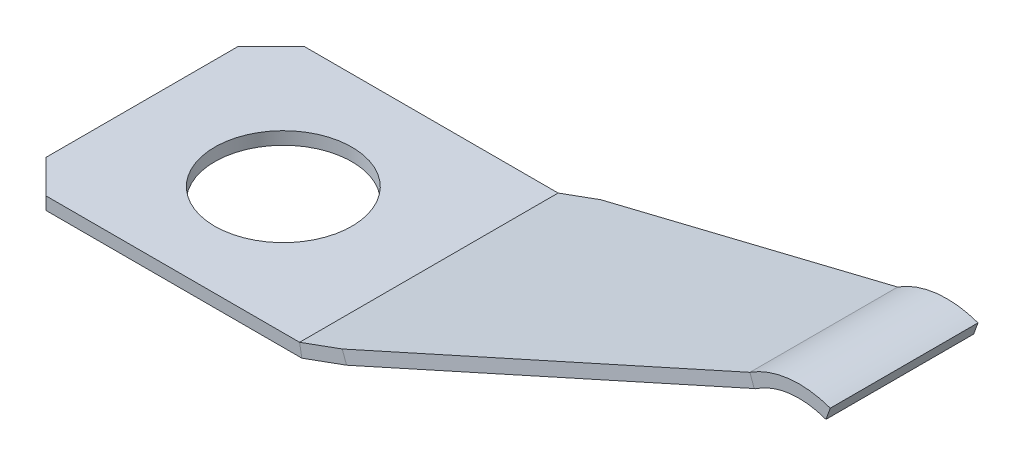
ISO-10303-21;
HEADER;
FILE_DESCRIPTION(('STEP AP214'),'2;1');
FILE_NAME('part.step','',(''),(''),'','','');
FILE_SCHEMA(('AUTOMOTIVE_DESIGN { 1 0 10303 214 1 1 1 1 }'));
ENDSEC;
DATA;
#1=APPLICATION_CONTEXT('core data for automotive mechanical design processes');
#2=APPLICATION_PROTOCOL_DEFINITION('international standard','automotive_design',2000,#1);
#3=PRODUCT_CONTEXT('',#1,'mechanical');
#4=PRODUCT('Part','Part','',(#3));
#5=PRODUCT_RELATED_PRODUCT_CATEGORY('part','',(#4));
#6=PRODUCT_DEFINITION_FORMATION('','',#4);
#7=PRODUCT_DEFINITION_CONTEXT('part definition',#1,'design');
#8=PRODUCT_DEFINITION('design','',#6,#7);
#9=PRODUCT_DEFINITION_SHAPE('','',#8);
#10=(LENGTH_UNIT() NAMED_UNIT(*) SI_UNIT(.MILLI.,.METRE.));
#11=(NAMED_UNIT(*) PLANE_ANGLE_UNIT() SI_UNIT($,.RADIAN.));
#12=(NAMED_UNIT(*) SI_UNIT($,.STERADIAN.) SOLID_ANGLE_UNIT());
#13=UNCERTAINTY_MEASURE_WITH_UNIT(LENGTH_MEASURE(1.E-05),#10,'distance_accuracy_value','');
#14=(GEOMETRIC_REPRESENTATION_CONTEXT(3) GLOBAL_UNCERTAINTY_ASSIGNED_CONTEXT((#13)) GLOBAL_UNIT_ASSIGNED_CONTEXT((#10,
#11,#12)) REPRESENTATION_CONTEXT('',''));
#15=CARTESIAN_POINT('',(0.,0.,0.));
#16=DIRECTION('',(0.,0.,1.));
#17=DIRECTION('',(1.,0.,0.));
#18=AXIS2_PLACEMENT_3D('',#15,#16,#17);
#19=CARTESIAN_POINT('',(14.9758937338187,-5.44411439079338,0.));
#20=DIRECTION('',(0.939826980375197,-0.34165076753732,0.));
#21=DIRECTION('',(0.34165076753732,0.939826980375197,0.));
#22=AXIS2_PLACEMENT_3D('',#19,#20,#21);
#23=PLANE('',#22);
#24=DIRECTION('',(-0.34165076753732,-0.939826980375197,0.));
#25=VECTOR('',#24,1.);
#26=CARTESIAN_POINT('',(14.9758937338187,-5.44411439079338,-1.77799999999999));
#27=LINE('',#26,#25);
#28=CARTESIAN_POINT('',(18.3482597843654,3.83272881623656,-1.77799999999999));
#29=VERTEX_POINT('',#28);
#30=CARTESIAN_POINT('',(18.24412463042,3.54626955261821,-1.77799999999999));
#31=VERTEX_POINT('',#30);
#32=EDGE_CURVE('E144',#29,#31,#27,.T.);
#33=ORIENTED_EDGE('',*,*,#32,.F.);
#34=DIRECTION('',(0.,0.,1.));
#35=VECTOR('',#34,1.);
#36=CARTESIAN_POINT('',(18.3482597843654,3.83272881623656,3.1115));
#37=LINE('',#36,#35);
#38=CARTESIAN_POINT('',(18.3482597843654,3.83272881623657,1.77800000000001));
#39=VERTEX_POINT('',#38);
#40=EDGE_CURVE('E39',#29,#39,#37,.T.);
#41=ORIENTED_EDGE('',*,*,#40,.T.);
#42=DIRECTION('',(-0.34165076753732,-0.939826980375197,0.));
#43=VECTOR('',#42,1.);
#44=CARTESIAN_POINT('',(14.9758937338187,-5.44411439079338,1.778));
#45=LINE('',#44,#43);
#46=CARTESIAN_POINT('',(18.24412463042,3.54626955261821,1.77800000000001));
#47=VERTEX_POINT('',#46);
#48=EDGE_CURVE('E250',#39,#47,#45,.T.);
#49=ORIENTED_EDGE('',*,*,#48,.T.);
#50=DIRECTION('',(0.,0.,-1.));
#51=VECTOR('',#50,1.);
#52=CARTESIAN_POINT('',(18.24412463042,3.54626955261821,3.1115));
#53=LINE('',#52,#51);
#54=EDGE_CURVE('E176',#47,#31,#53,.T.);
#55=ORIENTED_EDGE('',*,*,#54,.T.);
#56=EDGE_LOOP('',(#33,#41,#49,#55));
#57=FACE_BOUND('',#56,.T.);
#58=ADVANCED_FACE('F36',(#57),#23,.T.);
#59=CARTESIAN_POINT('',(17.6019578477569,1.77977076030499,0.));
#60=DIRECTION('',(0.,0.,-1.));
#61=DIRECTION('',(-1.,0.,0.));
#62=AXIS2_PLACEMENT_3D('',#59,#60,#61);
#63=CYLINDRICAL_SURFACE('',#62,2.1844);
#64=DIRECTION('',(0.,0.,-1.));
#65=VECTOR('',#64,1.);
#66=CARTESIAN_POINT('',(16.4127581503343,3.61209372300836,0.));
#67=LINE('',#66,#65);
#68=CARTESIAN_POINT('',(16.4127581503344,3.61209372300837,-1.77799999999999));
#69=VERTEX_POINT('',#68);
#70=CARTESIAN_POINT('',(16.4127581503343,3.61209372300837,1.77800000000001));
#71=VERTEX_POINT('',#70);
#72=EDGE_CURVE('E139',#69,#71,#67,.F.);
#73=ORIENTED_EDGE('',*,*,#72,.T.);
#74=CARTESIAN_POINT('',(17.6019578477569,1.77977076030499,1.778));
#75=DIRECTION('',(0.,0.,1.));
#76=DIRECTION('',(1.,0.,0.));
#77=AXIS2_PLACEMENT_3D('',#74,#75,#76);
#78=CIRCLE('',#77,2.1844);
#79=EDGE_CURVE('E318',#71,#39,#78,.F.);
#80=ORIENTED_EDGE('',*,*,#79,.T.);
#81=ORIENTED_EDGE('',*,*,#40,.F.);
#82=CARTESIAN_POINT('',(17.6019578477569,1.77977076030499,-1.77799999999999));
#83=DIRECTION('',(0.,0.,1.));
#84=DIRECTION('',(1.,0.,0.));
#85=AXIS2_PLACEMENT_3D('',#82,#83,#84);
#86=CIRCLE('',#85,2.1844);
#87=EDGE_CURVE('E134',#69,#29,#86,.F.);
#88=ORIENTED_EDGE('',*,*,#87,.F.);
#89=EDGE_LOOP('',(#73,#80,#81,#88));
#90=FACE_BOUND('',#89,.T.);
#91=ADVANCED_FACE('F136',(#90),#63,.T.);
#92=CARTESIAN_POINT('',(16.3986672328337,3.23750456866562,3.1115));
#93=CARTESIAN_POINT('',(16.4527157637113,3.27323014047098,3.1115));
#94=CARTESIAN_POINT('',(16.5119796989635,3.31241213983077,3.1115));
#95=CARTESIAN_POINT('',(17.0778813369714,3.68637167826548,3.1115));
#96=CARTESIAN_POINT('',(17.6780764722493,3.75204229601495,3.1115));
#97=CARTESIAN_POINT('',(18.24412463042,3.54626955261821,3.1115));
#98=CARTESIAN_POINT('',(16.3986672328336,3.23750456866562,-3.1115));
#99=CARTESIAN_POINT('',(16.4527157637113,3.27323014047099,-3.1115));
#100=CARTESIAN_POINT('',(16.5119796989635,3.31241213983077,-3.1115));
#101=CARTESIAN_POINT('',(17.0778813369714,3.68637167826548,-3.1115));
#102=CARTESIAN_POINT('',(17.6780764722493,3.75204229601495,-3.1115));
#103=CARTESIAN_POINT('',(18.24412463042,3.54626955261821,-3.1115));
#104=B_SPLINE_SURFACE_WITH_KNOTS('',1,3,((#92,#93,#94,#95,#96,#97),(#98,#99,#100,#101,#102,
#103)),.UNSPECIFIED.,.F.,.F.,.F.,(2,2),(4,2,4),(0.,1.),(-0.104482254604528,0.,1.),.UNSPECIFIED.);
#105=CARTESIAN_POINT('',(18.24412463042,3.54626955261821,-1.77799999999999));
#106=CARTESIAN_POINT('',(18.1945203412529,3.56431041816486,-1.778));
#107=CARTESIAN_POINT('',(18.1442007784733,3.58041418724115,-1.778));
#108=CARTESIAN_POINT('',(18.0424080655937,3.60853083883696,-1.778));
#109=CARTESIAN_POINT('',(17.9909343894134,3.6205418135995,-1.778));
#110=CARTESIAN_POINT('',(17.8872461438041,3.64022207934248,-1.778));
#111=CARTESIAN_POINT('',(17.8350329964879,3.64789878138324,-1.778));
#112=CARTESIAN_POINT('',(17.7301659683451,3.65878368530809,-1.778));
#113=CARTESIAN_POINT('',(17.6775121710325,3.66199271545994,-1.778));
#114=CARTESIAN_POINT('',(17.5190553275589,3.66473664834572,-1.77799999999999));
#115=CARTESIAN_POINT('',(17.4130391116852,3.65733397663574,-1.778));
#116=CARTESIAN_POINT('',(17.2040308580571,3.62403896871849,-1.778));
#117=CARTESIAN_POINT('',(17.1010381784282,3.59815058687919,-1.77799999999999));
#118=CARTESIAN_POINT('',(16.919576653864,3.53557102684672,-1.77799999999999));
#119=CARTESIAN_POINT('',(16.8400988939679,3.50176899572118,-1.778));
#120=CARTESIAN_POINT('',(16.7248509252923,3.44338760455797,-1.778));
#121=CARTESIAN_POINT('',(16.6870919881304,3.42264439794958,-1.778));
#122=CARTESIAN_POINT('',(16.6315167864174,3.3897445615648,-1.778));
#123=CARTESIAN_POINT('',(16.613170163479,3.37848129356857,-1.778));
#124=CARTESIAN_POINT('',(16.5859351313361,3.36113907481291,-1.778));
#125=CARTESIAN_POINT('',(16.5769039237213,3.35528354492225,-1.778));
#126=CARTESIAN_POINT('',(16.5634144938784,3.34641363148056,-1.778));
#127=CARTESIAN_POINT('',(16.558927640875,3.34344259781044,-1.778));
#128=CARTESIAN_POINT('',(16.5499545370556,3.33749989607502,-1.778));
#129=CARTESIAN_POINT('',(16.5454682862262,3.33452822803011,-1.778));
#130=CARTESIAN_POINT('',(16.5409729681662,3.33157028903263,-1.77799999999999));
#131=B_SPLINE_CURVE_WITH_KNOTS('',3,(#105,#106,#107,#108,#109,#110,#111,#112,#113,#114,#115,
#116,#117,#118,#119,#120,#121,#122,#123,#124,#125,#126,#127,#128,#129,#130),.UNSPECIFIED.,.F.,
.F.,(4,2,2,2,2,2,2,2,2,2,2,2,4),(0.,0.158323633961175,0.3167209660221,0.474846631939453,
0.632942978819137,0.949986668378509,1.26696255789288,1.52522639046649,1.65439003177369,
1.71896283775865,1.75125176387074,1.76739579228144,1.78353936266909),.UNSPECIFIED.);
#132=CARTESIAN_POINT('',(16.5504989452111,3.33786588733702,-1.77799999999999));
#133=VERTEX_POINT('',#132);
#134=EDGE_CURVE('E316',#31,#133,#131,.T.);
#135=CARTESIAN_POINT('',(18.24412463042,3.54626955261821,1.77800000000001));
#136=CARTESIAN_POINT('',(18.1945203412529,3.56431041816486,1.77800000000001));
#137=CARTESIAN_POINT('',(18.1442007784733,3.58041418724115,1.77800000000001));
#138=CARTESIAN_POINT('',(18.0424080655937,3.60853083883696,1.77800000000001));
#139=CARTESIAN_POINT('',(17.9909343894134,3.6205418135995,1.77800000000001));
#140=CARTESIAN_POINT('',(17.8872461438041,3.64022207934248,1.77800000000001));
#141=CARTESIAN_POINT('',(17.8350329964879,3.64789878138324,1.77800000000001));
#142=CARTESIAN_POINT('',(17.7301659683451,3.65878368530809,1.77800000000001));
#143=CARTESIAN_POINT('',(17.6775121710325,3.66199271545994,1.77800000000001));
#144=CARTESIAN_POINT('',(17.5190553275589,3.66473664834572,1.77800000000001));
#145=CARTESIAN_POINT('',(17.4130391116852,3.65733397663574,1.77800000000001));
#146=CARTESIAN_POINT('',(17.2040308580571,3.62403896871848,1.778));
#147=CARTESIAN_POINT('',(17.1010381784282,3.59815058687919,1.77800000000001));
#148=CARTESIAN_POINT('',(16.919576653864,3.53557102684673,1.77800000000001));
#149=CARTESIAN_POINT('',(16.8400988939679,3.50176899572118,1.77800000000001));
#150=CARTESIAN_POINT('',(16.7248509252923,3.44338760455797,1.77800000000001));
#151=CARTESIAN_POINT('',(16.6870919881304,3.42264439794958,1.77800000000001));
#152=CARTESIAN_POINT('',(16.6315167864174,3.3897445615648,1.77800000000001));
#153=CARTESIAN_POINT('',(16.613170163479,3.37848129356857,1.77800000000001));
#154=CARTESIAN_POINT('',(16.5859351313361,3.36113907481291,1.77800000000001));
#155=CARTESIAN_POINT('',(16.5769039237213,3.35528354492225,1.77800000000001));
#156=CARTESIAN_POINT('',(16.5634144938784,3.34641363148056,1.77800000000001));
#157=CARTESIAN_POINT('',(16.558927640875,3.34344259781044,1.77800000000001));
#158=CARTESIAN_POINT('',(16.5499545370556,3.33749989607502,1.77800000000001));
#159=CARTESIAN_POINT('',(16.5454682862262,3.33452822803011,1.77800000000001));
#160=CARTESIAN_POINT('',(16.5409729681662,3.33157028903263,1.77800000000001));
#161=B_SPLINE_CURVE_WITH_KNOTS('',3,(#135,#136,#137,#138,#139,#140,#141,#142,#143,#144,#145,
#146,#147,#148,#149,#150,#151,#152,#153,#154,#155,#156,#157,#158,#159,#160),.UNSPECIFIED.,.F.,
.F.,(4,2,2,2,2,2,2,2,2,2,2,2,4),(0.,0.158323633961177,0.3167209660221,0.474846631939452,
0.632942978819132,0.949986668378508,1.26696255789288,1.52522639046649,1.65439003177369,
1.71896283775865,1.75125176387074,1.76739579228143,1.78353936266909),.UNSPECIFIED.);
#162=CARTESIAN_POINT('',(16.5504989452111,3.33786588733702,1.77800000000001));
#163=VERTEX_POINT('',#162);
#164=EDGE_CURVE('E237',#47,#163,#161,.T.);
#165=DIRECTION('',(0.,0.,-1.));
#166=VECTOR('',#165,1.);
#167=CARTESIAN_POINT('',(16.5504986109951,3.33786576569232,0.));
#168=LINE('',#167,#166);
#169=EDGE_CURVE('E163',#133,#163,#168,.F.);
#170=ORIENTED_EDGE('',*,*,#134,.F.);
#171=ORIENTED_EDGE('',*,*,#54,.F.);
#172=ORIENTED_EDGE('',*,*,#164,.T.);
#173=ORIENTED_EDGE('',*,*,#169,.F.);
#174=EDGE_LOOP('',(#170,#171,#172,#173));
#175=FACE_BOUND('',#174,.T.);
#176=ADVANCED_FACE('F252',(#175),#104,.T.);
#177=CARTESIAN_POINT('',(6.69413760599998,0.0748051267426414,3.1115));
#178=DIRECTION('',(-0.34202014332567,0.939692620785908,0.));
#179=DIRECTION('',(-0.939692620785908,-0.34202014332567,0.));
#180=AXIS2_PLACEMENT_3D('',#177,#178,#179);
#181=PLANE('',#180);
#182=DIRECTION('',(0.929596127225608,0.338345320199261,0.146196732338349));
#183=VECTOR('',#182,1.);
#184=CARTESIAN_POINT('',(1.33523546130827,-1.87567574227046,-4.14922819720822));
#185=LINE('',#184,#183);
#186=CARTESIAN_POINT('',(7.9336600485624,0.525954400540304,-3.1115));
#187=VERTEX_POINT('',#186);
#188=EDGE_CURVE('E151',#187,#69,#185,.T.);
#189=ORIENTED_EDGE('',*,*,#188,.F.);
#190=DIRECTION('',(0.939692620785908,0.34202014332567,0.));
#191=VECTOR('',#190,1.);
#192=CARTESIAN_POINT('',(6.69413760599998,0.0748051267426414,-3.1115));
#193=LINE('',#192,#191);
#194=CARTESIAN_POINT('',(6.90732776814003,0.152399999999997,-3.1115));
#195=VERTEX_POINT('',#194);
#196=EDGE_CURVE('E221',#195,#187,#193,.T.);
#197=ORIENTED_EDGE('',*,*,#196,.F.);
#198=DIRECTION('',(0.,0.,-1.));
#199=VECTOR('',#198,1.);
#200=CARTESIAN_POINT('',(6.90732776814003,0.152399999999997,3.1115));
#201=LINE('',#200,#199);
#202=CARTESIAN_POINT('',(6.90732776814003,0.152400000000011,3.1115));
#203=VERTEX_POINT('',#202);
#204=EDGE_CURVE('E198',#203,#195,#201,.T.);
#205=ORIENTED_EDGE('',*,*,#204,.F.);
#206=DIRECTION('',(0.939692620785908,0.34202014332567,0.));
#207=VECTOR('',#206,1.);
#208=CARTESIAN_POINT('',(6.69413760599998,0.0748051267426414,3.1115));
#209=LINE('',#208,#207);
#210=CARTESIAN_POINT('',(7.93366004856241,0.525954400540304,3.1115));
#211=VERTEX_POINT('',#210);
#212=EDGE_CURVE('E164',#203,#211,#209,.T.);
#213=ORIENTED_EDGE('',*,*,#212,.T.);
#214=DIRECTION('',(0.929596127225608,0.338345320199261,-0.146196732338348));
#215=VECTOR('',#214,1.);
#216=CARTESIAN_POINT('',(1.33523546130827,-1.87567574227046,4.14922819720822));
#217=LINE('',#216,#215);
#218=EDGE_CURVE('E61',#211,#71,#217,.T.);
#219=ORIENTED_EDGE('',*,*,#218,.T.);
#220=ORIENTED_EDGE('',*,*,#72,.F.);
#221=EDGE_LOOP('',(#189,#197,#205,#213,#219,#220));
#222=FACE_BOUND('',#221,.T.);
#223=ADVANCED_FACE('F161',(#222),#181,.T.);
#224=CARTESIAN_POINT('',(6.79838534568565,-0.211613184072909,3.1115));
#225=DIRECTION('',(0.34202014332567,-0.939692620785908,0.));
#226=DIRECTION('',(0.939692620785908,0.34202014332567,0.));
#227=AXIS2_PLACEMENT_3D('',#224,#225,#226);
#228=PLANE('',#227);
#229=DIRECTION('',(-0.939692620785908,-0.34202014332567,0.));
#230=VECTOR('',#229,1.);
#231=CARTESIAN_POINT('',(6.79838534568564,-0.211613184072909,-1.77799999999999));
#232=LINE('',#231,#230);
#233=CARTESIAN_POINT('',(16.51700589002,3.32567541219281,-1.77799999999999));
#234=VERTEX_POINT('',#233);
#235=EDGE_CURVE('E11',#133,#234,#232,.T.);
#236=ORIENTED_EDGE('',*,*,#235,.F.);
#237=ORIENTED_EDGE('',*,*,#169,.T.);
#238=DIRECTION('',(-0.939692620785908,-0.34202014332567,0.));
#239=VECTOR('',#238,1.);
#240=CARTESIAN_POINT('',(6.79838534568564,-0.211613184072909,1.778));
#241=LINE('',#240,#239);
#242=CARTESIAN_POINT('',(16.51700589002,3.32567541219281,1.77800000000001));
#243=VERTEX_POINT('',#242);
#244=EDGE_CURVE('E45',#163,#243,#241,.T.);
#245=ORIENTED_EDGE('',*,*,#244,.T.);
#246=DIRECTION('',(-0.929596127225608,-0.338345320199261,0.146196732338348));
#247=VECTOR('',#246,1.);
#248=CARTESIAN_POINT('',(6.82487825945668,-0.20197055204127,3.302272044058));
#249=LINE('',#248,#247);
#250=CARTESIAN_POINT('',(8.03790778824807,0.239536089724768,3.1115));
#251=VERTEX_POINT('',#250);
#252=EDGE_CURVE('E150',#243,#251,#249,.T.);
#253=ORIENTED_EDGE('',*,*,#252,.T.);
#254=DIRECTION('',(0.939692620785908,0.34202014332567,0.));
#255=VECTOR('',#254,1.);
#256=CARTESIAN_POINT('',(6.79838534568565,-0.211613184072909,3.1115));
#257=LINE('',#256,#255);
#258=CARTESIAN_POINT('',(6.96107223185997,-0.152399999999997,3.1115));
#259=VERTEX_POINT('',#258);
#260=EDGE_CURVE('E169',#259,#251,#257,.T.);
#261=ORIENTED_EDGE('',*,*,#260,.F.);
#262=DIRECTION('',(0.,0.,1.));
#263=VECTOR('',#262,1.);
#264=CARTESIAN_POINT('',(6.96107223185997,-0.152399999999997,3.1115));
#265=LINE('',#264,#263);
#266=CARTESIAN_POINT('',(6.96107223185997,-0.152399999999997,-3.1115));
#267=VERTEX_POINT('',#266);
#268=EDGE_CURVE('E187',#267,#259,#265,.T.);
#269=ORIENTED_EDGE('',*,*,#268,.F.);
#270=DIRECTION('',(0.939692620785908,0.34202014332567,0.));
#271=VECTOR('',#270,1.);
#272=CARTESIAN_POINT('',(6.79838534568565,-0.211613184072909,-3.1115));
#273=LINE('',#272,#271);
#274=CARTESIAN_POINT('',(8.03790778824806,0.239536089724754,-3.1115));
#275=VERTEX_POINT('',#274);
#276=EDGE_CURVE('E223',#267,#275,#273,.T.);
#277=ORIENTED_EDGE('',*,*,#276,.T.);
#278=DIRECTION('',(-0.929596127225608,-0.338345320199261,-0.146196732338349));
#279=VECTOR('',#278,1.);
#280=CARTESIAN_POINT('',(7.67060832993672,0.105850019837331,-3.16926484972568));
#281=LINE('',#280,#279);
#282=EDGE_CURVE('E53',#234,#275,#281,.T.);
#283=ORIENTED_EDGE('',*,*,#282,.F.);
#284=EDGE_LOOP('',(#236,#237,#245,#253,#261,#269,#277,#283));
#285=FACE_BOUND('',#284,.T.);
#286=ADVANCED_FACE('F233',(#285),#228,.T.);
#287=CARTESIAN_POINT('',(6.69413760599998,0.0748051267426414,3.1115));
#288=DIRECTION('',(0.,0.,1.));
#289=DIRECTION('',(1.,0.,0.));
#290=AXIS2_PLACEMENT_3D('',#287,#288,#289);
#291=PLANE('',#290);
#292=ORIENTED_EDGE('',*,*,#260,.T.);
#293=DIRECTION('',(-0.34202014332567,0.939692620785908,0.));
#294=VECTOR('',#293,1.);
#295=CARTESIAN_POINT('',(7.93366004856242,0.525954400540304,3.1115));
#296=LINE('',#295,#294);
#297=EDGE_CURVE('E183',#251,#211,#296,.T.);
#298=ORIENTED_EDGE('',*,*,#297,.T.);
#299=ORIENTED_EDGE('',*,*,#212,.F.);
#300=DIRECTION('',(-0.173648177666931,0.984807753012208,0.));
#301=VECTOR('',#300,1.);
#302=CARTESIAN_POINT('',(6.6990463506054,1.33362261662832,3.1115));
#303=LINE('',#302,#301);
#304=EDGE_CURVE('E205',#259,#203,#303,.T.);
#305=ORIENTED_EDGE('',*,*,#304,.F.);
#306=EDGE_LOOP('',(#292,#298,#299,#305));
#307=FACE_BOUND('',#306,.T.);
#308=ADVANCED_FACE('F229',(#307),#291,.T.);
#309=CARTESIAN_POINT('',(0.,-9.71839898826321,0.));
#310=DIRECTION('',(1.,0.,0.));
#311=DIRECTION('',(0.,1.,0.));
#312=AXIS2_PLACEMENT_3D('',#309,#310,#311);
#313=PLANE('',#312);
#314=DIRECTION('',(0.,0.,-1.));
#315=VECTOR('',#314,1.);
#316=CARTESIAN_POINT('',(0.,-0.152399999999997,3.1115));
#317=LINE('',#316,#315);
#318=CARTESIAN_POINT('',(0.,-0.152399999999997,2.30886208272062));
#319=VERTEX_POINT('',#318);
#320=CARTESIAN_POINT('',(0.,-0.152399999999997,-2.30886208272062));
#321=VERTEX_POINT('',#320);
#322=EDGE_CURVE('E167',#319,#321,#317,.T.);
#323=ORIENTED_EDGE('',*,*,#322,.F.);
#324=DIRECTION('',(0.,1.,0.));
#325=VECTOR('',#324,1.);
#326=CARTESIAN_POINT('',(0.,-2.3876,2.30886208272062));
#327=LINE('',#326,#325);
#328=CARTESIAN_POINT('',(0.,0.152399999999997,2.30886208272062));
#329=VERTEX_POINT('',#328);
#330=EDGE_CURVE('E333',#319,#329,#327,.T.);
#331=ORIENTED_EDGE('',*,*,#330,.T.);
#332=DIRECTION('',(0.,0.,1.));
#333=VECTOR('',#332,1.);
#334=CARTESIAN_POINT('',(0.,0.152399999999997,3.1115));
#335=LINE('',#334,#333);
#336=CARTESIAN_POINT('',(0.,0.152399999999997,-2.30886208272062));
#337=VERTEX_POINT('',#336);
#338=EDGE_CURVE('E211',#337,#329,#335,.T.);
#339=ORIENTED_EDGE('',*,*,#338,.F.);
#340=DIRECTION('',(0.,1.,0.));
#341=VECTOR('',#340,1.);
#342=CARTESIAN_POINT('',(0.,-2.3876,-2.30886208272062));
#343=LINE('',#342,#341);
#344=EDGE_CURVE('E334',#321,#337,#343,.T.);
#345=ORIENTED_EDGE('',*,*,#344,.F.);
#346=EDGE_LOOP('',(#323,#331,#339,#345));
#347=FACE_BOUND('',#346,.T.);
#348=ADVANCED_FACE('F277',(#347),#313,.F.);
#349=CARTESIAN_POINT('',(6.69413760599998,0.0748051267426414,-3.1115));
#350=DIRECTION('',(0.,0.,-1.));
#351=DIRECTION('',(0.,1.,0.));
#352=AXIS2_PLACEMENT_3D('',#349,#350,#351);
#353=PLANE('',#352);
#354=DIRECTION('',(-0.342020143325661,0.939692620785911,0.));
#355=VECTOR('',#354,1.);
#356=CARTESIAN_POINT('',(7.9336600485624,0.525954400540291,-3.1115));
#357=LINE('',#356,#355);
#358=EDGE_CURVE('E155',#275,#187,#357,.T.);
#359=ORIENTED_EDGE('',*,*,#358,.F.);
#360=ORIENTED_EDGE('',*,*,#276,.F.);
#361=DIRECTION('',(0.173648177666931,-0.984807753012208,0.));
#362=VECTOR('',#361,1.);
#363=CARTESIAN_POINT('',(6.6990463506054,1.33362261662832,-3.1115));
#364=LINE('',#363,#362);
#365=EDGE_CURVE('E192',#195,#267,#364,.T.);
#366=ORIENTED_EDGE('',*,*,#365,.F.);
#367=ORIENTED_EDGE('',*,*,#196,.T.);
#368=EDGE_LOOP('',(#359,#360,#366,#367));
#369=FACE_BOUND('',#368,.T.);
#370=ADVANCED_FACE('F295',(#369),#353,.T.);
#371=CARTESIAN_POINT('',(0.,0.152399999999997,3.1115));
#372=DIRECTION('',(0.,1.,0.));
#373=DIRECTION('',(0.,0.,1.));
#374=AXIS2_PLACEMENT_3D('',#371,#372,#373);
#375=PLANE('',#374);
#376=CARTESIAN_POINT('',(3.4671,0.152399999999997,0.0635000000000011));
#377=DIRECTION('',(0.,1.,0.));
#378=DIRECTION('',(0.,0.,1.));
#379=AXIS2_PLACEMENT_3D('',#376,#377,#378);
#380=CIRCLE('',#379,1.651);
#381=CARTESIAN_POINT('',(3.4671,0.152399999999996,1.7145));
#382=VERTEX_POINT('',#381);
#383=EDGE_CURVE('E143',#382,#382,#380,.T.);
#384=ORIENTED_EDGE('',*,*,#383,.F.);
#385=EDGE_LOOP('',(#384));
#386=FACE_BOUND('',#385,.T.);
#387=DIRECTION('',(-0.707106781186548,0.,-0.707106781186547));
#388=VECTOR('',#387,1.);
#389=CARTESIAN_POINT('',(0.,0.152399999999997,2.30886208272062));
#390=LINE('',#389,#388);
#391=CARTESIAN_POINT('',(0.802637917279384,0.152399999999997,3.1115));
#392=VERTEX_POINT('',#391);
#393=EDGE_CURVE('E331',#392,#329,#390,.T.);
#394=ORIENTED_EDGE('',*,*,#393,.F.);
#395=DIRECTION('',(1.,0.,0.));
#396=VECTOR('',#395,1.);
#397=CARTESIAN_POINT('',(0.,0.152399999999997,3.1115));
#398=LINE('',#397,#396);
#399=EDGE_CURVE('E209',#392,#203,#398,.T.);
#400=ORIENTED_EDGE('',*,*,#399,.T.);
#401=ORIENTED_EDGE('',*,*,#204,.T.);
#402=DIRECTION('',(1.,0.,0.));
#403=VECTOR('',#402,1.);
#404=CARTESIAN_POINT('',(0.,0.152399999999997,-3.1115));
#405=LINE('',#404,#403);
#406=CARTESIAN_POINT('',(0.802637917279383,0.152399999999997,-3.1115));
#407=VERTEX_POINT('',#406);
#408=EDGE_CURVE('E215',#407,#195,#405,.T.);
#409=ORIENTED_EDGE('',*,*,#408,.F.);
#410=DIRECTION('',(0.707106781186549,0.,-0.707106781186546));
#411=VECTOR('',#410,1.);
#412=CARTESIAN_POINT('',(0.,0.152399999999997,-2.30886208272062));
#413=LINE('',#412,#411);
#414=EDGE_CURVE('E330',#337,#407,#413,.T.);
#415=ORIENTED_EDGE('',*,*,#414,.F.);
#416=ORIENTED_EDGE('',*,*,#338,.T.);
#417=EDGE_LOOP('',(#394,#400,#401,#409,#415,#416));
#418=FACE_BOUND('',#417,.T.);
#419=ADVANCED_FACE('F291',(#386,#418),#375,.T.);
#420=CARTESIAN_POINT('',(0.,0.152399999999997,-3.1115));
#421=DIRECTION('',(0.,0.,-1.));
#422=DIRECTION('',(0.,1.,0.));
#423=AXIS2_PLACEMENT_3D('',#420,#421,#422);
#424=PLANE('',#423);
#425=DIRECTION('',(0.,-1.,0.));
#426=VECTOR('',#425,1.);
#427=CARTESIAN_POINT('',(0.802637917279383,0.152399999999997,-3.1115));
#428=LINE('',#427,#426);
#429=CARTESIAN_POINT('',(0.802637917279384,-0.152399999999997,-3.1115));
#430=VERTEX_POINT('',#429);
#431=EDGE_CURVE('E178',#407,#430,#428,.T.);
#432=ORIENTED_EDGE('',*,*,#431,.F.);
#433=ORIENTED_EDGE('',*,*,#408,.T.);
#434=ORIENTED_EDGE('',*,*,#365,.T.);
#435=DIRECTION('',(1.,0.,0.));
#436=VECTOR('',#435,1.);
#437=CARTESIAN_POINT('',(0.,-0.152399999999997,-3.1115));
#438=LINE('',#437,#436);
#439=EDGE_CURVE('E208',#430,#267,#438,.T.);
#440=ORIENTED_EDGE('',*,*,#439,.F.);
#441=EDGE_LOOP('',(#432,#433,#434,#440));
#442=FACE_BOUND('',#441,.T.);
#443=ADVANCED_FACE('F287',(#442),#424,.T.);
#444=CARTESIAN_POINT('',(0.,-0.152399999999997,3.1115));
#445=DIRECTION('',(0.,-1.,0.));
#446=DIRECTION('',(0.,0.,-1.));
#447=AXIS2_PLACEMENT_3D('',#444,#445,#446);
#448=PLANE('',#447);
#449=CARTESIAN_POINT('',(3.4671,-0.152399999999997,0.0635000000000011));
#450=DIRECTION('',(0.,1.,0.));
#451=DIRECTION('',(0.,0.,1.));
#452=AXIS2_PLACEMENT_3D('',#449,#450,#451);
#453=CIRCLE('',#452,1.651);
#454=CARTESIAN_POINT('',(3.4671,-0.152399999999998,1.7145));
#455=VERTEX_POINT('',#454);
#456=EDGE_CURVE('E327',#455,#455,#453,.T.);
#457=ORIENTED_EDGE('',*,*,#456,.T.);
#458=EDGE_LOOP('',(#457));
#459=FACE_BOUND('',#458,.T.);
#460=DIRECTION('',(0.707106781186548,0.,0.707106781186547));
#461=VECTOR('',#460,1.);
#462=CARTESIAN_POINT('',(0.401318958639689,-0.152399999999997,2.71018104136031));
#463=LINE('',#462,#461);
#464=CARTESIAN_POINT('',(0.802637917279384,-0.152399999999997,3.1115));
#465=VERTEX_POINT('',#464);
#466=EDGE_CURVE('E337',#319,#465,#463,.T.);
#467=ORIENTED_EDGE('',*,*,#466,.F.);
#468=ORIENTED_EDGE('',*,*,#322,.T.);
#469=DIRECTION('',(-0.707106781186549,0.,0.707106781186546));
#470=VECTOR('',#469,1.);
#471=CARTESIAN_POINT('',(-2.71018104136031,-0.152399999999997,0.401318958639686));
#472=LINE('',#471,#470);
#473=EDGE_CURVE('E185',#430,#321,#472,.T.);
#474=ORIENTED_EDGE('',*,*,#473,.F.);
#475=ORIENTED_EDGE('',*,*,#439,.T.);
#476=ORIENTED_EDGE('',*,*,#268,.T.);
#477=DIRECTION('',(1.,0.,0.));
#478=VECTOR('',#477,1.);
#479=CARTESIAN_POINT('',(0.,-0.152399999999997,3.1115));
#480=LINE('',#479,#478);
#481=EDGE_CURVE('E206',#465,#259,#480,.T.);
#482=ORIENTED_EDGE('',*,*,#481,.F.);
#483=EDGE_LOOP('',(#467,#468,#474,#475,#476,#482));
#484=FACE_BOUND('',#483,.T.);
#485=ADVANCED_FACE('F283',(#459,#484),#448,.T.);
#486=CARTESIAN_POINT('',(0.,0.152399999999997,3.1115));
#487=DIRECTION('',(0.,0.,1.));
#488=DIRECTION('',(1.,0.,0.));
#489=AXIS2_PLACEMENT_3D('',#486,#487,#488);
#490=PLANE('',#489);
#491=DIRECTION('',(0.,1.,0.));
#492=VECTOR('',#491,1.);
#493=CARTESIAN_POINT('',(0.802637917279384,0.152399999999997,3.1115));
#494=LINE('',#493,#492);
#495=EDGE_CURVE('E186',#465,#392,#494,.T.);
#496=ORIENTED_EDGE('',*,*,#495,.F.);
#497=ORIENTED_EDGE('',*,*,#481,.T.);
#498=ORIENTED_EDGE('',*,*,#304,.T.);
#499=ORIENTED_EDGE('',*,*,#399,.F.);
#500=EDGE_LOOP('',(#496,#497,#498,#499));
#501=FACE_BOUND('',#500,.T.);
#502=ADVANCED_FACE('F276',(#501),#490,.T.);
#503=CARTESIAN_POINT('',(0.,-2.3876,2.30886208272062));
#504=DIRECTION('',(0.707106781186547,0.,-0.707106781186548));
#505=DIRECTION('',(-0.707106781186548,0.,-0.707106781186547));
#506=AXIS2_PLACEMENT_3D('',#503,#504,#505);
#507=PLANE('',#506);
#508=ORIENTED_EDGE('',*,*,#466,.T.);
#509=ORIENTED_EDGE('',*,*,#495,.T.);
#510=ORIENTED_EDGE('',*,*,#393,.T.);
#511=ORIENTED_EDGE('',*,*,#330,.F.);
#512=EDGE_LOOP('',(#508,#509,#510,#511));
#513=FACE_BOUND('',#512,.T.);
#514=ADVANCED_FACE('F273',(#513),#507,.F.);
#515=CARTESIAN_POINT('',(0.,-2.3876,-2.30886208272062));
#516=DIRECTION('',(0.707106781186546,0.,0.707106781186549));
#517=DIRECTION('',(0.707106781186549,0.,-0.707106781186546));
#518=AXIS2_PLACEMENT_3D('',#515,#516,#517);
#519=PLANE('',#518);
#520=ORIENTED_EDGE('',*,*,#431,.T.);
#521=ORIENTED_EDGE('',*,*,#473,.T.);
#522=ORIENTED_EDGE('',*,*,#344,.T.);
#523=ORIENTED_EDGE('',*,*,#414,.T.);
#524=EDGE_LOOP('',(#520,#521,#522,#523));
#525=FACE_BOUND('',#524,.T.);
#526=ADVANCED_FACE('F271',(#525),#519,.F.);
#527=CARTESIAN_POINT('',(3.4671,0.152399999999997,0.0635000000000011));
#528=DIRECTION('',(0.,1.,0.));
#529=DIRECTION('',(0.,0.,1.));
#530=AXIS2_PLACEMENT_3D('',#527,#528,#529);
#531=CYLINDRICAL_SURFACE('',#530,1.651);
#532=ORIENTED_EDGE('',*,*,#456,.F.);
#533=EDGE_LOOP('',(#532));
#534=FACE_BOUND('',#533,.T.);
#535=ORIENTED_EDGE('',*,*,#383,.T.);
#536=EDGE_LOOP('',(#535));
#537=FACE_BOUND('',#536,.T.);
#538=ADVANCED_FACE('F268',(#534,#537),#531,.F.);
#539=CARTESIAN_POINT('',(2.20396662535547,-4.26249499906667,4.14922819720822));
#540=DIRECTION('',(0.137379990561358,0.0500022273481065,0.989255535973183));
#541=DIRECTION('',(0.990494539389491,0.,-0.137552053563735));
#542=AXIS2_PLACEMENT_3D('',#539,#540,#541);
#543=PLANE('',#542);
#544=DIRECTION('',(-0.34202014332567,0.939692620785908,0.));
#545=VECTOR('',#544,1.);
#546=CARTESIAN_POINT('',(17.2814893143815,1.22527446621216,1.77800000000001));
#547=LINE('',#546,#545);
#548=EDGE_CURVE('E159',#243,#71,#547,.T.);
#549=ORIENTED_EDGE('',*,*,#548,.T.);
#550=ORIENTED_EDGE('',*,*,#218,.F.);
#551=ORIENTED_EDGE('',*,*,#297,.F.);
#552=ORIENTED_EDGE('',*,*,#252,.F.);
#553=EDGE_LOOP('',(#549,#550,#551,#552));
#554=FACE_BOUND('',#553,.T.);
#555=ADVANCED_FACE('F263',(#554),#543,.T.);
#556=CARTESIAN_POINT('',(1.62775460546657,-4.47221902293264,1.778));
#557=DIRECTION('',(0.,0.,1.));
#558=DIRECTION('',(1.,0.,0.));
#559=AXIS2_PLACEMENT_3D('',#556,#557,#558);
#560=PLANE('',#559);
#561=ORIENTED_EDGE('',*,*,#79,.F.);
#562=ORIENTED_EDGE('',*,*,#548,.F.);
#563=ORIENTED_EDGE('',*,*,#244,.F.);
#564=ORIENTED_EDGE('',*,*,#164,.F.);
#565=ORIENTED_EDGE('',*,*,#48,.F.);
#566=EDGE_LOOP('',(#561,#562,#563,#564,#565));
#567=FACE_BOUND('',#566,.T.);
#568=ADVANCED_FACE('F258',(#567),#560,.T.);
#569=CARTESIAN_POINT('',(1.62775460546657,-4.47221902293264,-1.778));
#570=DIRECTION('',(0.,0.,1.));
#571=DIRECTION('',(1.,0.,0.));
#572=AXIS2_PLACEMENT_3D('',#569,#570,#571);
#573=PLANE('',#572);
#574=ORIENTED_EDGE('',*,*,#87,.T.);
#575=ORIENTED_EDGE('',*,*,#32,.T.);
#576=ORIENTED_EDGE('',*,*,#134,.T.);
#577=ORIENTED_EDGE('',*,*,#235,.T.);
#578=DIRECTION('',(-0.34202014332567,0.939692620785908,0.));
#579=VECTOR('',#578,1.);
#580=CARTESIAN_POINT('',(17.2814893143816,1.22527446621216,-1.77799999999999));
#581=LINE('',#580,#579);
#582=EDGE_CURVE('E146',#234,#69,#581,.T.);
#583=ORIENTED_EDGE('',*,*,#582,.T.);
#584=EDGE_LOOP('',(#574,#575,#576,#577,#583));
#585=FACE_BOUND('',#584,.T.);
#586=ADVANCED_FACE('F148',(#585),#573,.F.);
#587=CARTESIAN_POINT('',(2.20396662535547,-4.26249499906667,-4.14922819720822));
#588=DIRECTION('',(-0.137379990561359,-0.0500022273481067,0.989255535973183));
#589=DIRECTION('',(0.990494539389491,0.,0.137552053563736));
#590=AXIS2_PLACEMENT_3D('',#587,#588,#589);
#591=PLANE('',#590);
#592=ORIENTED_EDGE('',*,*,#282,.T.);
#593=ORIENTED_EDGE('',*,*,#358,.T.);
#594=ORIENTED_EDGE('',*,*,#188,.T.);
#595=ORIENTED_EDGE('',*,*,#582,.F.);
#596=EDGE_LOOP('',(#592,#593,#594,#595));
#597=FACE_BOUND('',#596,.T.);
#598=ADVANCED_FACE('F154',(#597),#591,.F.);
#599=CLOSED_SHELL('',(#58,#91,#176,#223,#286,#308,#348,#370,#419,#443,#485,#502,#514,#526,#538,
#555,#568,#586,#598));
#600=MANIFOLD_SOLID_BREP('B2',#599);
#601=ADVANCED_BREP_SHAPE_REPRESENTATION('',(#18,#600),#14);
#602=SHAPE_DEFINITION_REPRESENTATION(#9,#601);
ENDSEC;
END-ISO-10303-21;
